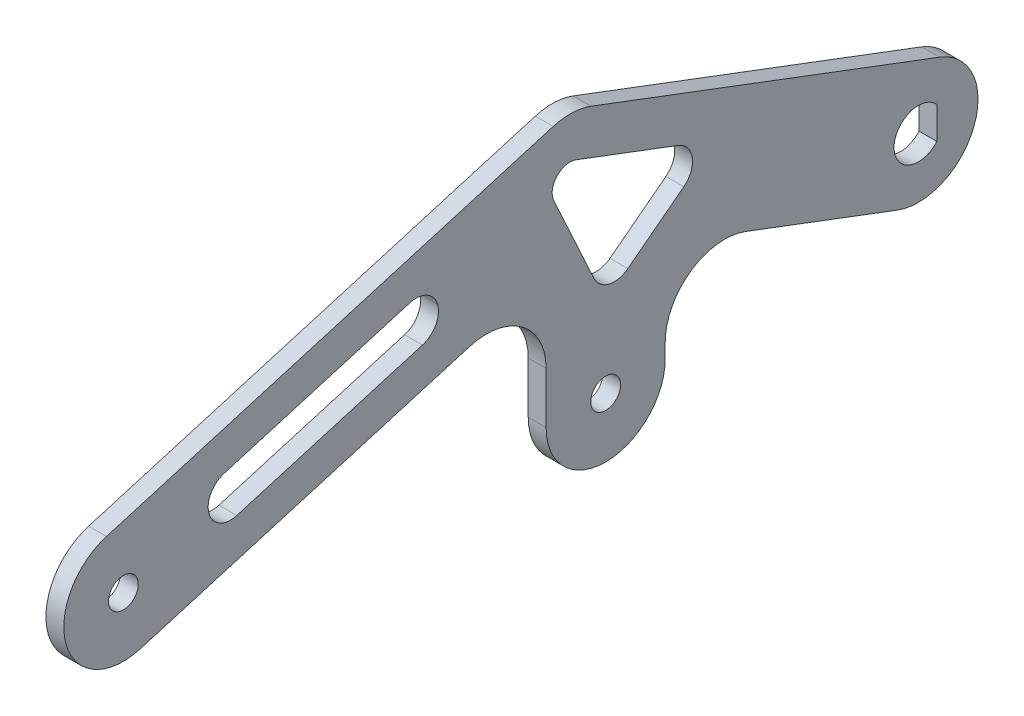
ISO-10303-21;
HEADER;
FILE_DESCRIPTION(('STEP AP214'),'2;1');
FILE_NAME('part.step','',(''),(''),'','','');
FILE_SCHEMA(('AUTOMOTIVE_DESIGN { 1 0 10303 214 1 1 1 1 }'));
ENDSEC;
DATA;
#1=APPLICATION_CONTEXT('core data for automotive mechanical design processes');
#2=APPLICATION_PROTOCOL_DEFINITION('international standard','automotive_design',2000,#1);
#3=PRODUCT_CONTEXT('',#1,'mechanical');
#4=PRODUCT('Part','Part','',(#3));
#5=PRODUCT_RELATED_PRODUCT_CATEGORY('part','',(#4));
#6=PRODUCT_DEFINITION_FORMATION('','',#4);
#7=PRODUCT_DEFINITION_CONTEXT('part definition',#1,'design');
#8=PRODUCT_DEFINITION('design','',#6,#7);
#9=PRODUCT_DEFINITION_SHAPE('','',#8);
#10=(LENGTH_UNIT() NAMED_UNIT(*) SI_UNIT(.MILLI.,.METRE.));
#11=(NAMED_UNIT(*) PLANE_ANGLE_UNIT() SI_UNIT($,.RADIAN.));
#12=(NAMED_UNIT(*) SI_UNIT($,.STERADIAN.) SOLID_ANGLE_UNIT());
#13=UNCERTAINTY_MEASURE_WITH_UNIT(LENGTH_MEASURE(1.E-05),#10,'distance_accuracy_value','');
#14=(GEOMETRIC_REPRESENTATION_CONTEXT(3) GLOBAL_UNCERTAINTY_ASSIGNED_CONTEXT((#13)) GLOBAL_UNIT_ASSIGNED_CONTEXT((#10,
#11,#12)) REPRESENTATION_CONTEXT('',''));
#15=CARTESIAN_POINT('',(0.,0.,0.));
#16=DIRECTION('',(0.,0.,1.));
#17=DIRECTION('',(1.,0.,0.));
#18=AXIS2_PLACEMENT_3D('',#15,#16,#17);
#19=CARTESIAN_POINT('',(3.,-1.49353266513425,-90.9802292545983));
#20=DIRECTION('',(1.,0.,0.));
#21=DIRECTION('',(0.,0.,-1.));
#22=AXIS2_PLACEMENT_3D('',#19,#20,#21);
#23=PLANE('',#22);
#24=DIRECTION('',(0.,1.,0.));
#25=VECTOR('',#24,1.);
#26=CARTESIAN_POINT('',(3.,12.6832815729998,-146.6));
#27=LINE('',#26,#25);
#28=CARTESIAN_POINT('',(3.,7.31671842700024,-146.6));
#29=VERTEX_POINT('',#28);
#30=CARTESIAN_POINT('',(3.,12.6832815729998,-146.6));
#31=VERTEX_POINT('',#30);
#32=EDGE_CURVE('E295',#29,#31,#27,.T.);
#33=ORIENTED_EDGE('',*,*,#32,.F.);
#34=CARTESIAN_POINT('',(3.,10.,-143.5));
#35=DIRECTION('',(1.,0.,0.));
#36=DIRECTION('',(0.,0.,-1.));
#37=AXIS2_PLACEMENT_3D('',#34,#35,#36);
#38=CIRCLE('',#37,4.1);
#39=EDGE_CURVE('E291',#31,#29,#38,.T.);
#40=ORIENTED_EDGE('',*,*,#39,.F.);
#41=EDGE_LOOP('',(#33,#40));
#42=FACE_BOUND('',#41,.T.);
#43=DIRECTION('',(0.,0.282841783069722,-0.959166578728607));
#44=VECTOR('',#43,1.);
#45=CARTESIAN_POINT('',(3.,0.408334212721614,-12.8284178306949));
#46=LINE('',#45,#44);
#47=CARTESIAN_POINT('',(3.,0.408334212721614,-12.8284178306949));
#48=VERTEX_POINT('',#47);
#49=CARTESIAN_POINT('',(3.,16.7222546895087,-68.1518114239011));
#50=VERTEX_POINT('',#49);
#51=EDGE_CURVE('E343',#48,#50,#46,.T.);
#52=ORIENTED_EDGE('',*,*,#51,.T.);
#53=CARTESIAN_POINT('',(3.,7.13058890222264,-70.9802292545983));
#54=DIRECTION('',(1.,0.,0.));
#55=DIRECTION('',(0.,0.,-1.));
#56=AXIS2_PLACEMENT_3D('',#53,#54,#55);
#57=CIRCLE('',#56,10.);
#58=CARTESIAN_POINT('',(3.,7.13058890222264,-80.9802292545983));
#59=VERTEX_POINT('',#58);
#60=EDGE_CURVE('E263',#50,#59,#57,.F.);
#61=ORIENTED_EDGE('',*,*,#60,.T.);
#62=DIRECTION('',(0.,-1.,0.));
#63=VECTOR('',#62,1.);
#64=CARTESIAN_POINT('',(3.,20.5051352169009,-80.9802292545983));
#65=LINE('',#64,#63);
#66=CARTESIAN_POINT('',(3.,-1.49353266513425,-80.9802292545983));
#67=VERTEX_POINT('',#66);
#68=EDGE_CURVE('E314',#59,#67,#65,.T.);
#69=ORIENTED_EDGE('',*,*,#68,.T.);
#70=CARTESIAN_POINT('',(3.,-1.49353266513425,-90.9802292545983));
#71=DIRECTION('',(1.,0.,0.));
#72=DIRECTION('',(0.,0.,-1.));
#73=AXIS2_PLACEMENT_3D('',#70,#71,#72);
#74=CIRCLE('',#73,9.99999999999999);
#75=CARTESIAN_POINT('',(3.,-1.49353266513425,-100.980229254598));
#76=VERTEX_POINT('',#75);
#77=EDGE_CURVE('E317',#67,#76,#74,.T.);
#78=ORIENTED_EDGE('',*,*,#77,.T.);
#79=DIRECTION('',(0.,1.,0.));
#80=VECTOR('',#79,1.);
#81=CARTESIAN_POINT('',(3.,15.3840401127578,-100.980229254598));
#82=LINE('',#81,#80);
#83=CARTESIAN_POINT('',(3.,0.912721051605862,-100.980229254598));
#84=VERTEX_POINT('',#83);
#85=EDGE_CURVE('E321',#76,#84,#82,.T.);
#86=ORIENTED_EDGE('',*,*,#85,.T.);
#87=CARTESIAN_POINT('',(3.,0.912721051605853,-110.980229254598));
#88=DIRECTION('',(1.,0.,0.));
#89=DIRECTION('',(0.,0.,-1.));
#90=AXIS2_PLACEMENT_3D('',#87,#88,#89);
#91=CIRCLE('',#90,10.);
#92=CARTESIAN_POINT('',(3.,10.2665846063096,-114.516503650058));
#93=VERTEX_POINT('',#92);
#94=EDGE_CURVE('E426',#84,#93,#91,.F.);
#95=ORIENTED_EDGE('',*,*,#94,.T.);
#96=DIRECTION('',(0.,-0.353627439545988,-0.935386355470374));
#97=VECTOR('',#96,1.);
#98=CARTESIAN_POINT('',(3.,15.3840401127578,-100.980229254598));
#99=LINE('',#98,#97);
#100=CARTESIAN_POINT('',(3.,0.64613644529626,-139.96372560454));
#101=VERTEX_POINT('',#100);
#102=EDGE_CURVE('E325',#93,#101,#99,.T.);
#103=ORIENTED_EDGE('',*,*,#102,.T.);
#104=CARTESIAN_POINT('',(3.,10.,-143.5));
#105=DIRECTION('',(1.,0.,0.));
#106=DIRECTION('',(0.,0.,-1.));
#107=AXIS2_PLACEMENT_3D('',#104,#105,#106);
#108=CIRCLE('',#107,10.);
#109=CARTESIAN_POINT('',(3.,19.3538635547037,-147.03627439546));
#110=VERTEX_POINT('',#109);
#111=EDGE_CURVE('E328',#101,#110,#108,.T.);
#112=ORIENTED_EDGE('',*,*,#111,.T.);
#113=DIRECTION('',(0.,0.353627439545988,0.935386355470374));
#114=VECTOR('',#113,1.);
#115=CARTESIAN_POINT('',(3.,19.3538635547037,-147.03627439546));
#116=LINE('',#115,#114);
#117=CARTESIAN_POINT('',(3.,41.4700779857315,-88.5362743954599));
#118=VERTEX_POINT('',#117);
#119=EDGE_CURVE('E331',#110,#118,#116,.T.);
#120=ORIENTED_EDGE('',*,*,#119,.T.);
#121=CARTESIAN_POINT('',(3.,32.1162144310277,-85.));
#122=DIRECTION('',(1.,0.,0.));
#123=DIRECTION('',(0.,0.,-1.));
#124=AXIS2_PLACEMENT_3D('',#121,#122,#123);
#125=CIRCLE('',#124,9.99999999999999);
#126=CARTESIAN_POINT('',(3.,41.7078802183132,-82.1715821693008));
#127=VERTEX_POINT('',#126);
#128=EDGE_CURVE('E334',#118,#127,#125,.T.);
#129=ORIENTED_EDGE('',*,*,#128,.T.);
#130=DIRECTION('',(0.,-0.282841783069918,0.959166578728549));
#131=VECTOR('',#130,1.);
#132=CARTESIAN_POINT('',(3.,19.5916657872778,-7.17158216930308));
#133=LINE('',#132,#131);
#134=CARTESIAN_POINT('',(3.,19.5916657872778,-7.17158216930308));
#135=VERTEX_POINT('',#134);
#136=EDGE_CURVE('E337',#127,#135,#133,.T.);
#137=ORIENTED_EDGE('',*,*,#136,.T.);
#138=CARTESIAN_POINT('',(3.,10.,-10.));
#139=DIRECTION('',(1.,0.,0.));
#140=DIRECTION('',(0.,0.,-1.));
#141=AXIS2_PLACEMENT_3D('',#138,#139,#140);
#142=CIRCLE('',#141,9.99999999999199);
#143=EDGE_CURVE('E340',#135,#48,#142,.T.);
#144=ORIENTED_EDGE('',*,*,#143,.T.);
#145=EDGE_LOOP('',(#52,#61,#69,#78,#86,#95,#103,#112,#120,#129,#137,#144));
#146=FACE_BOUND('',#145,.T.);
#147=CARTESIAN_POINT('',(3.,10.,-10.));
#148=DIRECTION('',(1.,0.,0.));
#149=DIRECTION('',(0.,0.,-1.));
#150=AXIS2_PLACEMENT_3D('',#147,#148,#149);
#151=CIRCLE('',#150,2.5);
#152=CARTESIAN_POINT('',(3.,10.,-12.5));
#153=VERTEX_POINT('',#152);
#154=EDGE_CURVE('E283',#153,#153,#151,.T.);
#155=ORIENTED_EDGE('',*,*,#154,.F.);
#156=EDGE_LOOP('',(#155));
#157=FACE_BOUND('',#156,.T.);
#158=CARTESIAN_POINT('',(3.,-1.49353266513425,-90.9802292545983));
#159=DIRECTION('',(1.,0.,0.));
#160=DIRECTION('',(0.,0.,-1.));
#161=AXIS2_PLACEMENT_3D('',#158,#159,#160);
#162=CIRCLE('',#161,2.49999999999999);
#163=CARTESIAN_POINT('',(3.,-1.49353266513425,-93.4802292545983));
#164=VERTEX_POINT('',#163);
#165=EDGE_CURVE('E270',#164,#164,#162,.T.);
#166=ORIENTED_EDGE('',*,*,#165,.F.);
#167=EDGE_LOOP('',(#166));
#168=FACE_BOUND('',#167,.T.);
#169=DIRECTION('',(0.,-0.353627439545988,-0.935386355470374));
#170=VECTOR('',#169,1.);
#171=CARTESIAN_POINT('',(3.,28.741265144375,-102.410644154323));
#172=LINE('',#171,#170);
#173=CARTESIAN_POINT('',(3.,34.9223734974389,-86.060882318638));
#174=VERTEX_POINT('',#173);
#175=CARTESIAN_POINT('',(3.,28.4635451329216,-103.145246394715));
#176=VERTEX_POINT('',#175);
#177=EDGE_CURVE('E257',#174,#176,#172,.T.);
#178=ORIENTED_EDGE('',*,*,#177,.T.);
#179=CARTESIAN_POINT('',(3.,24.9558462999077,-101.819143496417));
#180=DIRECTION('',(1.,0.,0.));
#181=DIRECTION('',(0.,0.,-1.));
#182=AXIS2_PLACEMENT_3D('',#179,#180,#181);
#183=CIRCLE('',#182,3.75);
#184=CARTESIAN_POINT('',(3.,21.9809519676192,-104.102234320655));
#185=VERTEX_POINT('',#184);
#186=EDGE_CURVE('E472',#176,#185,#183,.F.);
#187=ORIENTED_EDGE('',*,*,#186,.T.);
#188=DIRECTION('',(0.,-0.608824219796667,0.793305155276946));
#189=VECTOR('',#188,1.);
#190=CARTESIAN_POINT('',(3.,6.94202628156058,-84.5063363773015));
#191=LINE('',#190,#189);
#192=CARTESIAN_POINT('',(3.,14.7720847878221,-94.7089951697061));
#193=VERTEX_POINT('',#192);
#194=EDGE_CURVE('E519',#185,#193,#191,.T.);
#195=ORIENTED_EDGE('',*,*,#194,.T.);
#196=CARTESIAN_POINT('',(3.,17.7469791201106,-92.4259043454686));
#197=DIRECTION('',(1.,0.,0.));
#198=DIRECTION('',(0.,0.,-1.));
#199=AXIS2_PLACEMENT_3D('',#196,#197,#198);
#200=CIRCLE('',#199,3.75);
#201=CARTESIAN_POINT('',(3.,16.1816510353007,-89.0182294802702));
#202=VERTEX_POINT('',#201);
#203=EDGE_CURVE('E467',#193,#202,#200,.F.);
#204=ORIENTED_EDGE('',*,*,#203,.T.);
#205=DIRECTION('',(0.,0.908713297386252,0.417420822615985));
#206=VECTOR('',#205,1.);
#207=CARTESIAN_POINT('',(3.,0.84197625683953,-96.064565968472));
#208=LINE('',#207,#206);
#209=CARTESIAN_POINT('',(3.,30.8639519631798,-82.2738601078412));
#210=VERTEX_POINT('',#209);
#211=EDGE_CURVE('E527',#202,#210,#208,.T.);
#212=ORIENTED_EDGE('',*,*,#211,.T.);
#213=CARTESIAN_POINT('',(3.,32.1162144310277,-85.));
#214=DIRECTION('',(1.,0.,0.));
#215=DIRECTION('',(0.,0.,-1.));
#216=AXIS2_PLACEMENT_3D('',#213,#214,#215);
#217=CIRCLE('',#216,3.00000000000001);
#218=EDGE_CURVE('E269',#174,#210,#217,.T.);
#219=ORIENTED_EDGE('',*,*,#218,.F.);
#220=EDGE_LOOP('',(#178,#187,#195,#204,#212,#219));
#221=FACE_BOUND('',#220,.T.);
#222=CARTESIAN_POINT('',(3.,24.4956413823256,-59.1572871598404));
#223=DIRECTION('',(1.,0.,0.));
#224=DIRECTION('',(0.,0.,-1.));
#225=AXIS2_PLACEMENT_3D('',#222,#223,#224);
#226=CIRCLE('',#225,3.75);
#227=CARTESIAN_POINT('',(3.,28.0925160525577,-58.0966304733282));
#228=VERTEX_POINT('',#227);
#229=CARTESIAN_POINT('',(3.,25.5562980688378,-62.7541618300724));
#230=VERTEX_POINT('',#229);
#231=EDGE_CURVE('E478',#228,#230,#226,.F.);
#232=ORIENTED_EDGE('',*,*,#231,.T.);
#233=CARTESIAN_POINT('',(3.,24.4956413823256,-59.1572871598404));
#234=DIRECTION('',(1.,0.,0.));
#235=DIRECTION('',(0.,0.,-1.));
#236=AXIS2_PLACEMENT_3D('',#233,#234,#235);
#237=CIRCLE('',#236,3.75);
#238=CARTESIAN_POINT('',(3.,20.8987667120936,-60.2179438463526));
#239=VERTEX_POINT('',#238);
#240=EDGE_CURVE('E484',#230,#239,#237,.F.);
#241=ORIENTED_EDGE('',*,*,#240,.T.);
#242=DIRECTION('',(0.,-0.282841783069918,0.959166578728549));
#243=VECTOR('',#242,1.);
#244=CARTESIAN_POINT('',(3.,27.4529683230725,-82.4444022828199));
#245=LINE('',#244,#243);
#246=CARTESIAN_POINT('',(3.,11.7064087623212,-29.0450300376748));
#247=VERTEX_POINT('',#246);
#248=EDGE_CURVE('E518',#239,#247,#245,.T.);
#249=ORIENTED_EDGE('',*,*,#248,.T.);
#250=CARTESIAN_POINT('',(3.,15.3032834325533,-27.9843733511626));
#251=DIRECTION('',(1.,0.,0.));
#252=DIRECTION('',(0.,0.,-1.));
#253=AXIS2_PLACEMENT_3D('',#250,#251,#252);
#254=CIRCLE('',#253,3.75);
#255=CARTESIAN_POINT('',(3.,14.2426267460411,-24.3874986809305));
#256=VERTEX_POINT('',#255);
#257=EDGE_CURVE('E80',#247,#256,#254,.F.);
#258=ORIENTED_EDGE('',*,*,#257,.T.);
#259=CARTESIAN_POINT('',(3.,15.3032834325533,-27.9843733511625));
#260=DIRECTION('',(1.,0.,0.));
#261=DIRECTION('',(0.,0.,-1.));
#262=AXIS2_PLACEMENT_3D('',#259,#260,#261);
#263=CIRCLE('',#262,3.75);
#264=CARTESIAN_POINT('',(3.,18.9001581027853,-26.9237166646504));
#265=VERTEX_POINT('',#264);
#266=EDGE_CURVE('E12',#256,#265,#263,.F.);
#267=ORIENTED_EDGE('',*,*,#266,.T.);
#268=DIRECTION('',(0.,0.282841783069918,-0.959166578728549));
#269=VECTOR('',#268,1.);
#270=CARTESIAN_POINT('',(3.,34.6467176635366,-80.3230889097955));
#271=LINE('',#270,#269);
#272=EDGE_CURVE('E512',#265,#228,#271,.T.);
#273=ORIENTED_EDGE('',*,*,#272,.T.);
#274=EDGE_LOOP('',(#232,#241,#249,#258,#267,#273));
#275=FACE_BOUND('',#274,.T.);
#276=ADVANCED_FACE('F63',(#42,#146,#157,#168,#221,#275),#23,.T.);
#277=CARTESIAN_POINT('',(0.,-1.49353266513425,-90.9802292545983));
#278=DIRECTION('',(1.,0.,0.));
#279=DIRECTION('',(0.,0.,-1.));
#280=AXIS2_PLACEMENT_3D('',#277,#278,#279);
#281=PLANE('',#280);
#282=DIRECTION('',(0.,-0.908713297386252,-0.417420822615985));
#283=VECTOR('',#282,1.);
#284=CARTESIAN_POINT('',(0.,11.9104331472534,-90.9802292545983));
#285=LINE('',#284,#283);
#286=CARTESIAN_POINT('',(0.,30.8639519631798,-82.2738601078412));
#287=VERTEX_POINT('',#286);
#288=CARTESIAN_POINT('',(0.,16.1816510353007,-89.0182294802702));
#289=VERTEX_POINT('',#288);
#290=EDGE_CURVE('E896',#287,#289,#285,.T.);
#291=ORIENTED_EDGE('',*,*,#290,.T.);
#292=CARTESIAN_POINT('',(0.,17.7469791201106,-92.4259043454686));
#293=DIRECTION('',(1.,0.,0.));
#294=DIRECTION('',(0.,0.,-1.));
#295=AXIS2_PLACEMENT_3D('',#292,#293,#294);
#296=CIRCLE('',#295,3.75);
#297=CARTESIAN_POINT('',(0.,14.7720847878221,-94.7089951697061));
#298=VERTEX_POINT('',#297);
#299=EDGE_CURVE('E464',#289,#298,#296,.T.);
#300=ORIENTED_EDGE('',*,*,#299,.T.);
#301=DIRECTION('',(0.,0.608824219796667,-0.793305155276946));
#302=VECTOR('',#301,1.);
#303=CARTESIAN_POINT('',(0.,26.0816875087892,-109.445541205397));
#304=LINE('',#303,#302);
#305=CARTESIAN_POINT('',(0.,21.9809519676192,-104.102234320655));
#306=VERTEX_POINT('',#305);
#307=EDGE_CURVE('E250',#298,#306,#304,.T.);
#308=ORIENTED_EDGE('',*,*,#307,.T.);
#309=CARTESIAN_POINT('',(0.,24.9558462999077,-101.819143496417));
#310=DIRECTION('',(1.,0.,0.));
#311=DIRECTION('',(0.,0.,-1.));
#312=AXIS2_PLACEMENT_3D('',#309,#310,#311);
#313=CIRCLE('',#312,3.75);
#314=CARTESIAN_POINT('',(0.,28.4635451329216,-103.145246394715));
#315=VERTEX_POINT('',#314);
#316=EDGE_CURVE('E246',#306,#315,#313,.T.);
#317=ORIENTED_EDGE('',*,*,#316,.T.);
#318=DIRECTION('',(0.,0.353627439545988,0.935386355470374));
#319=VECTOR('',#318,1.);
#320=CARTESIAN_POINT('',(0.,34.9223734974389,-86.060882318638));
#321=LINE('',#320,#319);
#322=CARTESIAN_POINT('',(0.,34.9223734974389,-86.060882318638));
#323=VERTEX_POINT('',#322);
#324=EDGE_CURVE('E238',#315,#323,#321,.T.);
#325=ORIENTED_EDGE('',*,*,#324,.T.);
#326=CARTESIAN_POINT('',(0.,32.1162144310277,-85.));
#327=DIRECTION('',(1.,0.,0.));
#328=DIRECTION('',(0.,0.,-1.));
#329=AXIS2_PLACEMENT_3D('',#326,#327,#328);
#330=CIRCLE('',#329,3.00000000000001);
#331=EDGE_CURVE('E244',#323,#287,#330,.T.);
#332=ORIENTED_EDGE('',*,*,#331,.T.);
#333=EDGE_LOOP('',(#291,#300,#308,#317,#325,#332));
#334=FACE_BOUND('',#333,.T.);
#335=DIRECTION('',(0.,-1.,0.));
#336=VECTOR('',#335,1.);
#337=CARTESIAN_POINT('',(0.,20.5051352169009,-80.9802292545983));
#338=LINE('',#337,#336);
#339=CARTESIAN_POINT('',(0.,7.13058890222264,-80.9802292545983));
#340=VERTEX_POINT('',#339);
#341=CARTESIAN_POINT('',(0.,-1.49353266513425,-80.9802292545983));
#342=VERTEX_POINT('',#341);
#343=EDGE_CURVE('E313',#340,#342,#338,.T.);
#344=ORIENTED_EDGE('',*,*,#343,.F.);
#345=CARTESIAN_POINT('',(0.,7.13058890222264,-70.9802292545983));
#346=DIRECTION('',(1.,0.,0.));
#347=DIRECTION('',(0.,0.,-1.));
#348=AXIS2_PLACEMENT_3D('',#345,#346,#347);
#349=CIRCLE('',#348,10.);
#350=CARTESIAN_POINT('',(0.,16.7222546895087,-68.1518114239011));
#351=VERTEX_POINT('',#350);
#352=EDGE_CURVE('E429',#340,#351,#349,.T.);
#353=ORIENTED_EDGE('',*,*,#352,.T.);
#354=DIRECTION('',(0.,0.282841783069722,-0.959166578728607));
#355=VECTOR('',#354,1.);
#356=CARTESIAN_POINT('',(0.,0.408334212721614,-12.8284178306949));
#357=LINE('',#356,#355);
#358=CARTESIAN_POINT('',(0.,0.408334212721614,-12.8284178306949));
#359=VERTEX_POINT('',#358);
#360=EDGE_CURVE('E318',#359,#351,#357,.T.);
#361=ORIENTED_EDGE('',*,*,#360,.F.);
#362=CARTESIAN_POINT('',(0.,10.,-10.));
#363=DIRECTION('',(1.,0.,0.));
#364=DIRECTION('',(0.,0.,-1.));
#365=AXIS2_PLACEMENT_3D('',#362,#363,#364);
#366=CIRCLE('',#365,9.99999999999199);
#367=CARTESIAN_POINT('',(0.,19.5916657872778,-7.17158216930308));
#368=VERTEX_POINT('',#367);
#369=EDGE_CURVE('E372',#368,#359,#366,.T.);
#370=ORIENTED_EDGE('',*,*,#369,.F.);
#371=DIRECTION('',(0.,-0.282841783069918,0.959166578728549));
#372=VECTOR('',#371,1.);
#373=CARTESIAN_POINT('',(0.,19.5916657872778,-7.17158216930308));
#374=LINE('',#373,#372);
#375=CARTESIAN_POINT('',(0.,41.7078802183132,-82.1715821693008));
#376=VERTEX_POINT('',#375);
#377=EDGE_CURVE('E369',#376,#368,#374,.T.);
#378=ORIENTED_EDGE('',*,*,#377,.F.);
#379=CARTESIAN_POINT('',(0.,32.1162144310277,-85.));
#380=DIRECTION('',(1.,0.,0.));
#381=DIRECTION('',(0.,0.,-1.));
#382=AXIS2_PLACEMENT_3D('',#379,#380,#381);
#383=CIRCLE('',#382,9.99999999999999);
#384=CARTESIAN_POINT('',(0.,41.4700779857315,-88.5362743954599));
#385=VERTEX_POINT('',#384);
#386=EDGE_CURVE('E366',#385,#376,#383,.T.);
#387=ORIENTED_EDGE('',*,*,#386,.F.);
#388=DIRECTION('',(0.,0.353627439545988,0.935386355470374));
#389=VECTOR('',#388,1.);
#390=CARTESIAN_POINT('',(0.,19.3538635547037,-147.03627439546));
#391=LINE('',#390,#389);
#392=CARTESIAN_POINT('',(0.,19.3538635547037,-147.03627439546));
#393=VERTEX_POINT('',#392);
#394=EDGE_CURVE('E363',#393,#385,#391,.T.);
#395=ORIENTED_EDGE('',*,*,#394,.F.);
#396=CARTESIAN_POINT('',(0.,10.,-143.5));
#397=DIRECTION('',(1.,0.,0.));
#398=DIRECTION('',(0.,0.,-1.));
#399=AXIS2_PLACEMENT_3D('',#396,#397,#398);
#400=CIRCLE('',#399,10.);
#401=CARTESIAN_POINT('',(0.,0.64613644529626,-139.96372560454));
#402=VERTEX_POINT('',#401);
#403=EDGE_CURVE('E360',#402,#393,#400,.T.);
#404=ORIENTED_EDGE('',*,*,#403,.F.);
#405=DIRECTION('',(0.,-0.353627439545988,-0.935386355470374));
#406=VECTOR('',#405,1.);
#407=CARTESIAN_POINT('',(0.,15.3840401127578,-100.980229254598));
#408=LINE('',#407,#406);
#409=CARTESIAN_POINT('',(0.,10.2665846063096,-114.516503650058));
#410=VERTEX_POINT('',#409);
#411=EDGE_CURVE('E357',#410,#402,#408,.T.);
#412=ORIENTED_EDGE('',*,*,#411,.F.);
#413=CARTESIAN_POINT('',(0.,0.912721051605853,-110.980229254598));
#414=DIRECTION('',(1.,0.,0.));
#415=DIRECTION('',(0.,0.,-1.));
#416=AXIS2_PLACEMENT_3D('',#413,#414,#415);
#417=CIRCLE('',#416,10.);
#418=CARTESIAN_POINT('',(0.,0.912721051605862,-100.980229254598));
#419=VERTEX_POINT('',#418);
#420=EDGE_CURVE('E423',#410,#419,#417,.T.);
#421=ORIENTED_EDGE('',*,*,#420,.T.);
#422=DIRECTION('',(0.,1.,0.));
#423=VECTOR('',#422,1.);
#424=CARTESIAN_POINT('',(0.,15.3840401127578,-100.980229254598));
#425=LINE('',#424,#423);
#426=CARTESIAN_POINT('',(0.,-1.49353266513425,-100.980229254598));
#427=VERTEX_POINT('',#426);
#428=EDGE_CURVE('E353',#427,#419,#425,.T.);
#429=ORIENTED_EDGE('',*,*,#428,.F.);
#430=CARTESIAN_POINT('',(0.,-1.49353266513425,-90.9802292545983));
#431=DIRECTION('',(1.,0.,0.));
#432=DIRECTION('',(0.,0.,-1.));
#433=AXIS2_PLACEMENT_3D('',#430,#431,#432);
#434=CIRCLE('',#433,9.99999999999999);
#435=EDGE_CURVE('E350',#342,#427,#434,.T.);
#436=ORIENTED_EDGE('',*,*,#435,.F.);
#437=EDGE_LOOP('',(#344,#353,#361,#370,#378,#387,#395,#404,#412,#421,#429,#436));
#438=FACE_BOUND('',#437,.T.);
#439=CARTESIAN_POINT('',(0.,10.,-143.5));
#440=DIRECTION('',(1.,0.,0.));
#441=DIRECTION('',(0.,0.,-1.));
#442=AXIS2_PLACEMENT_3D('',#439,#440,#441);
#443=CIRCLE('',#442,4.1);
#444=CARTESIAN_POINT('',(0.,12.6832815729998,-146.6));
#445=VERTEX_POINT('',#444);
#446=CARTESIAN_POINT('',(0.,7.31671842700024,-146.6));
#447=VERTEX_POINT('',#446);
#448=EDGE_CURVE('E287',#445,#447,#443,.T.);
#449=ORIENTED_EDGE('',*,*,#448,.T.);
#450=DIRECTION('',(0.,1.,0.));
#451=VECTOR('',#450,1.);
#452=CARTESIAN_POINT('',(0.,12.6832815729998,-146.6));
#453=LINE('',#452,#451);
#454=EDGE_CURVE('E296',#447,#445,#453,.T.);
#455=ORIENTED_EDGE('',*,*,#454,.T.);
#456=EDGE_LOOP('',(#449,#455));
#457=FACE_BOUND('',#456,.T.);
#458=CARTESIAN_POINT('',(0.,10.,-10.));
#459=DIRECTION('',(1.,0.,0.));
#460=DIRECTION('',(0.,0.,-1.));
#461=AXIS2_PLACEMENT_3D('',#458,#459,#460);
#462=CIRCLE('',#461,2.5);
#463=CARTESIAN_POINT('',(0.,10.,-12.5));
#464=VERTEX_POINT('',#463);
#465=EDGE_CURVE('E276',#464,#464,#462,.T.);
#466=ORIENTED_EDGE('',*,*,#465,.T.);
#467=EDGE_LOOP('',(#466));
#468=FACE_BOUND('',#467,.T.);
#469=CARTESIAN_POINT('',(0.,-1.49353266513425,-90.9802292545983));
#470=DIRECTION('',(1.,0.,0.));
#471=DIRECTION('',(0.,0.,-1.));
#472=AXIS2_PLACEMENT_3D('',#469,#470,#471);
#473=CIRCLE('',#472,2.49999999999999);
#474=CARTESIAN_POINT('',(0.,-1.49353266513425,-93.4802292545983));
#475=VERTEX_POINT('',#474);
#476=EDGE_CURVE('E279',#475,#475,#473,.T.);
#477=ORIENTED_EDGE('',*,*,#476,.T.);
#478=EDGE_LOOP('',(#477));
#479=FACE_BOUND('',#478,.T.);
#480=DIRECTION('',(0.,-0.282841783069918,0.959166578728549));
#481=VECTOR('',#480,1.);
#482=CARTESIAN_POINT('',(0.,17.8395014162731,-23.3268419944183));
#483=LINE('',#482,#481);
#484=CARTESIAN_POINT('',(0.,28.0925160525577,-58.0966304733282));
#485=VERTEX_POINT('',#484);
#486=CARTESIAN_POINT('',(0.,18.9001581027853,-26.9237166646504));
#487=VERTEX_POINT('',#486);
#488=EDGE_CURVE('E909',#485,#487,#483,.T.);
#489=ORIENTED_EDGE('',*,*,#488,.T.);
#490=CARTESIAN_POINT('',(0.,15.3032834325533,-27.9843733511625));
#491=DIRECTION('',(1.,0.,0.));
#492=DIRECTION('',(0.,0.,-1.));
#493=AXIS2_PLACEMENT_3D('',#490,#491,#492);
#494=CIRCLE('',#493,3.75);
#495=CARTESIAN_POINT('',(0.,14.2426267460411,-24.3874986809305));
#496=VERTEX_POINT('',#495);
#497=EDGE_CURVE('E73',#487,#496,#494,.T.);
#498=ORIENTED_EDGE('',*,*,#497,.T.);
#499=CARTESIAN_POINT('',(0.,15.3032834325533,-27.9843733511626));
#500=DIRECTION('',(1.,0.,0.));
#501=DIRECTION('',(0.,0.,-1.));
#502=AXIS2_PLACEMENT_3D('',#499,#500,#501);
#503=CIRCLE('',#502,3.75);
#504=CARTESIAN_POINT('',(0.,11.7064087623212,-29.0450300376747));
#505=VERTEX_POINT('',#504);
#506=EDGE_CURVE('E487',#496,#505,#503,.T.);
#507=ORIENTED_EDGE('',*,*,#506,.T.);
#508=DIRECTION('',(0.,0.282841783069918,-0.959166578728549));
#509=VECTOR('',#508,1.);
#510=CARTESIAN_POINT('',(0.,21.9594233986058,-63.8148185165846));
#511=LINE('',#510,#509);
#512=CARTESIAN_POINT('',(0.,20.8987667120936,-60.2179438463526));
#513=VERTEX_POINT('',#512);
#514=EDGE_CURVE('E904',#505,#513,#511,.T.);
#515=ORIENTED_EDGE('',*,*,#514,.T.);
#516=CARTESIAN_POINT('',(0.,24.4956413823256,-59.1572871598404));
#517=DIRECTION('',(1.,0.,0.));
#518=DIRECTION('',(0.,0.,-1.));
#519=AXIS2_PLACEMENT_3D('',#516,#517,#518);
#520=CIRCLE('',#519,3.75);
#521=CARTESIAN_POINT('',(0.,25.5562980688378,-62.7541618300724));
#522=VERTEX_POINT('',#521);
#523=EDGE_CURVE('E481',#513,#522,#520,.T.);
#524=ORIENTED_EDGE('',*,*,#523,.T.);
#525=CARTESIAN_POINT('',(0.,24.4956413823256,-59.1572871598404));
#526=DIRECTION('',(1.,0.,0.));
#527=DIRECTION('',(0.,0.,-1.));
#528=AXIS2_PLACEMENT_3D('',#525,#526,#527);
#529=CIRCLE('',#528,3.75);
#530=EDGE_CURVE('E475',#522,#485,#529,.T.);
#531=ORIENTED_EDGE('',*,*,#530,.T.);
#532=EDGE_LOOP('',(#489,#498,#507,#515,#524,#531));
#533=FACE_BOUND('',#532,.T.);
#534=ADVANCED_FACE('F241',(#334,#438,#457,#468,#479,#533),#281,.F.);
#535=CARTESIAN_POINT('',(3.,32.1162144310277,-85.));
#536=DIRECTION('',(-1.,0.,0.));
#537=DIRECTION('',(0.,0.,1.));
#538=AXIS2_PLACEMENT_3D('',#535,#536,#537);
#539=CYLINDRICAL_SURFACE('',#538,3.00000000000001);
#540=ORIENTED_EDGE('',*,*,#218,.T.);
#541=DIRECTION('',(-1.,0.,0.));
#542=VECTOR('',#541,1.);
#543=CARTESIAN_POINT('',(3.,30.8639519631798,-82.2738601078412));
#544=LINE('',#543,#542);
#545=EDGE_CURVE('E262',#210,#287,#544,.T.);
#546=ORIENTED_EDGE('',*,*,#545,.T.);
#547=ORIENTED_EDGE('',*,*,#331,.F.);
#548=DIRECTION('',(-1.,0.,0.));
#549=VECTOR('',#548,1.);
#550=CARTESIAN_POINT('',(3.,34.9223734974389,-86.060882318638));
#551=LINE('',#550,#549);
#552=EDGE_CURVE('E254',#174,#323,#551,.T.);
#553=ORIENTED_EDGE('',*,*,#552,.F.);
#554=EDGE_LOOP('',(#540,#546,#547,#553));
#555=FACE_BOUND('',#554,.T.);
#556=ADVANCED_FACE('F266',(#555),#539,.F.);
#557=CARTESIAN_POINT('',(3.,20.5051352169009,-80.9802292545983));
#558=DIRECTION('',(0.,0.,-1.));
#559=DIRECTION('',(-1.,0.,0.));
#560=AXIS2_PLACEMENT_3D('',#557,#558,#559);
#561=PLANE('',#560);
#562=ORIENTED_EDGE('',*,*,#68,.F.);
#563=DIRECTION('',(-1.,0.,0.));
#564=VECTOR('',#563,1.);
#565=CARTESIAN_POINT('',(0.,7.13058890222264,-80.9802292545983));
#566=LINE('',#565,#564);
#567=EDGE_CURVE('E416',#59,#340,#566,.T.);
#568=ORIENTED_EDGE('',*,*,#567,.T.);
#569=ORIENTED_EDGE('',*,*,#343,.T.);
#570=DIRECTION('',(-1.,0.,0.));
#571=VECTOR('',#570,1.);
#572=CARTESIAN_POINT('',(3.,-1.49353266513425,-80.9802292545983));
#573=LINE('',#572,#571);
#574=EDGE_CURVE('E405',#67,#342,#573,.T.);
#575=ORIENTED_EDGE('',*,*,#574,.F.);
#576=EDGE_LOOP('',(#562,#568,#569,#575));
#577=FACE_BOUND('',#576,.T.);
#578=ADVANCED_FACE('F603',(#577),#561,.F.);
#579=CARTESIAN_POINT('',(3.,-1.49353266513425,-90.9802292545983));
#580=DIRECTION('',(-1.,0.,0.));
#581=DIRECTION('',(0.,0.,1.));
#582=AXIS2_PLACEMENT_3D('',#579,#580,#581);
#583=CYLINDRICAL_SURFACE('',#582,9.99999999999999);
#584=ORIENTED_EDGE('',*,*,#435,.T.);
#585=DIRECTION('',(-1.,0.,0.));
#586=VECTOR('',#585,1.);
#587=CARTESIAN_POINT('',(3.,-1.49353266513425,-100.980229254598));
#588=LINE('',#587,#586);
#589=EDGE_CURVE('E401',#76,#427,#588,.T.);
#590=ORIENTED_EDGE('',*,*,#589,.F.);
#591=ORIENTED_EDGE('',*,*,#77,.F.);
#592=ORIENTED_EDGE('',*,*,#574,.T.);
#593=EDGE_LOOP('',(#584,#590,#591,#592));
#594=FACE_BOUND('',#593,.T.);
#595=ADVANCED_FACE('F599',(#594),#583,.T.);
#596=CARTESIAN_POINT('',(3.,15.3840401127578,-100.980229254598));
#597=DIRECTION('',(0.,0.,1.));
#598=DIRECTION('',(0.,-1.,0.));
#599=AXIS2_PLACEMENT_3D('',#596,#597,#598);
#600=PLANE('',#599);
#601=ORIENTED_EDGE('',*,*,#428,.T.);
#602=DIRECTION('',(-1.,0.,0.));
#603=VECTOR('',#602,1.);
#604=CARTESIAN_POINT('',(3.,0.912721051605861,-100.980229254598));
#605=LINE('',#604,#603);
#606=EDGE_CURVE('E413',#419,#84,#605,.F.);
#607=ORIENTED_EDGE('',*,*,#606,.T.);
#608=ORIENTED_EDGE('',*,*,#85,.F.);
#609=ORIENTED_EDGE('',*,*,#589,.T.);
#610=EDGE_LOOP('',(#601,#607,#608,#609));
#611=FACE_BOUND('',#610,.T.);
#612=ADVANCED_FACE('F595',(#611),#600,.F.);
#613=CARTESIAN_POINT('',(3.,15.3840401127578,-100.980229254598));
#614=DIRECTION('',(0.,0.935386355470374,-0.353627439545988));
#615=DIRECTION('',(0.,0.353627439545988,0.935386355470374));
#616=AXIS2_PLACEMENT_3D('',#613,#614,#615);
#617=PLANE('',#616);
#618=ORIENTED_EDGE('',*,*,#102,.F.);
#619=DIRECTION('',(-1.,0.,0.));
#620=VECTOR('',#619,1.);
#621=CARTESIAN_POINT('',(0.,10.2665846063096,-114.516503650058));
#622=LINE('',#621,#620);
#623=EDGE_CURVE('E409',#93,#410,#622,.T.);
#624=ORIENTED_EDGE('',*,*,#623,.T.);
#625=ORIENTED_EDGE('',*,*,#411,.T.);
#626=DIRECTION('',(-1.,0.,0.));
#627=VECTOR('',#626,1.);
#628=CARTESIAN_POINT('',(3.,0.64613644529626,-139.96372560454));
#629=LINE('',#628,#627);
#630=EDGE_CURVE('E397',#101,#402,#629,.T.);
#631=ORIENTED_EDGE('',*,*,#630,.F.);
#632=EDGE_LOOP('',(#618,#624,#625,#631));
#633=FACE_BOUND('',#632,.T.);
#634=ADVANCED_FACE('F591',(#633),#617,.F.);
#635=CARTESIAN_POINT('',(3.,10.,-143.5));
#636=DIRECTION('',(-1.,0.,0.));
#637=DIRECTION('',(0.,0.,1.));
#638=AXIS2_PLACEMENT_3D('',#635,#636,#637);
#639=CYLINDRICAL_SURFACE('',#638,10.);
#640=ORIENTED_EDGE('',*,*,#403,.T.);
#641=DIRECTION('',(-1.,0.,0.));
#642=VECTOR('',#641,1.);
#643=CARTESIAN_POINT('',(3.,19.3538635547037,-147.03627439546));
#644=LINE('',#643,#642);
#645=EDGE_CURVE('E393',#110,#393,#644,.T.);
#646=ORIENTED_EDGE('',*,*,#645,.F.);
#647=ORIENTED_EDGE('',*,*,#111,.F.);
#648=ORIENTED_EDGE('',*,*,#630,.T.);
#649=EDGE_LOOP('',(#640,#646,#647,#648));
#650=FACE_BOUND('',#649,.T.);
#651=ADVANCED_FACE('F587',(#650),#639,.T.);
#652=CARTESIAN_POINT('',(3.,19.3538635547037,-147.03627439546));
#653=DIRECTION('',(0.,-0.935386355470374,0.353627439545988));
#654=DIRECTION('',(0.,-0.353627439545988,-0.935386355470374));
#655=AXIS2_PLACEMENT_3D('',#652,#653,#654);
#656=PLANE('',#655);
#657=ORIENTED_EDGE('',*,*,#394,.T.);
#658=DIRECTION('',(-1.,0.,0.));
#659=VECTOR('',#658,1.);
#660=CARTESIAN_POINT('',(3.,41.4700779857315,-88.5362743954599));
#661=LINE('',#660,#659);
#662=EDGE_CURVE('E389',#118,#385,#661,.T.);
#663=ORIENTED_EDGE('',*,*,#662,.F.);
#664=ORIENTED_EDGE('',*,*,#119,.F.);
#665=ORIENTED_EDGE('',*,*,#645,.T.);
#666=EDGE_LOOP('',(#657,#663,#664,#665));
#667=FACE_BOUND('',#666,.T.);
#668=ADVANCED_FACE('F583',(#667),#656,.F.);
#669=CARTESIAN_POINT('',(3.,32.1162144310277,-85.));
#670=DIRECTION('',(-1.,0.,0.));
#671=DIRECTION('',(0.,0.,1.));
#672=AXIS2_PLACEMENT_3D('',#669,#670,#671);
#673=CYLINDRICAL_SURFACE('',#672,9.99999999999999);
#674=ORIENTED_EDGE('',*,*,#386,.T.);
#675=DIRECTION('',(-1.,0.,0.));
#676=VECTOR('',#675,1.);
#677=CARTESIAN_POINT('',(3.,41.7078802183132,-82.1715821693008));
#678=LINE('',#677,#676);
#679=EDGE_CURVE('E385',#127,#376,#678,.T.);
#680=ORIENTED_EDGE('',*,*,#679,.F.);
#681=ORIENTED_EDGE('',*,*,#128,.F.);
#682=ORIENTED_EDGE('',*,*,#662,.T.);
#683=EDGE_LOOP('',(#674,#680,#681,#682));
#684=FACE_BOUND('',#683,.T.);
#685=ADVANCED_FACE('F579',(#684),#673,.T.);
#686=CARTESIAN_POINT('',(3.,19.5916657872778,-7.17158216930308));
#687=DIRECTION('',(0.,-0.959166578728549,-0.282841783069918));
#688=DIRECTION('',(0.,0.282841783069918,-0.959166578728549));
#689=AXIS2_PLACEMENT_3D('',#686,#687,#688);
#690=PLANE('',#689);
#691=ORIENTED_EDGE('',*,*,#377,.T.);
#692=DIRECTION('',(-1.,0.,0.));
#693=VECTOR('',#692,1.);
#694=CARTESIAN_POINT('',(3.,19.5916657872778,-7.17158216930308));
#695=LINE('',#694,#693);
#696=EDGE_CURVE('E381',#135,#368,#695,.T.);
#697=ORIENTED_EDGE('',*,*,#696,.F.);
#698=ORIENTED_EDGE('',*,*,#136,.F.);
#699=ORIENTED_EDGE('',*,*,#679,.T.);
#700=EDGE_LOOP('',(#691,#697,#698,#699));
#701=FACE_BOUND('',#700,.T.);
#702=ADVANCED_FACE('F575',(#701),#690,.F.);
#703=CARTESIAN_POINT('',(3.,10.,-10.));
#704=DIRECTION('',(-1.,0.,0.));
#705=DIRECTION('',(0.,0.,1.));
#706=AXIS2_PLACEMENT_3D('',#703,#704,#705);
#707=CYLINDRICAL_SURFACE('',#706,9.99999999999199);
#708=ORIENTED_EDGE('',*,*,#369,.T.);
#709=DIRECTION('',(-1.,0.,0.));
#710=VECTOR('',#709,1.);
#711=CARTESIAN_POINT('',(3.,0.408334212721614,-12.8284178306949));
#712=LINE('',#711,#710);
#713=EDGE_CURVE('E347',#48,#359,#712,.T.);
#714=ORIENTED_EDGE('',*,*,#713,.F.);
#715=ORIENTED_EDGE('',*,*,#143,.F.);
#716=ORIENTED_EDGE('',*,*,#696,.T.);
#717=EDGE_LOOP('',(#708,#714,#715,#716));
#718=FACE_BOUND('',#717,.T.);
#719=ADVANCED_FACE('F571',(#718),#707,.T.);
#720=CARTESIAN_POINT('',(3.,0.408334212721614,-12.8284178306949));
#721=DIRECTION('',(0.,0.959166578728607,0.282841783069722));
#722=DIRECTION('',(0.,-0.282841783069722,0.959166578728607));
#723=AXIS2_PLACEMENT_3D('',#720,#721,#722);
#724=PLANE('',#723);
#725=ORIENTED_EDGE('',*,*,#360,.T.);
#726=DIRECTION('',(-1.,0.,0.));
#727=VECTOR('',#726,1.);
#728=CARTESIAN_POINT('',(3.,16.7222546895087,-68.1518114239011));
#729=LINE('',#728,#727);
#730=EDGE_CURVE('E420',#351,#50,#729,.F.);
#731=ORIENTED_EDGE('',*,*,#730,.T.);
#732=ORIENTED_EDGE('',*,*,#51,.F.);
#733=ORIENTED_EDGE('',*,*,#713,.T.);
#734=EDGE_LOOP('',(#725,#731,#732,#733));
#735=FACE_BOUND('',#734,.T.);
#736=ADVANCED_FACE('F568',(#735),#724,.F.);
#737=CARTESIAN_POINT('',(3.,10.,-143.5));
#738=DIRECTION('',(-1.,0.,0.));
#739=DIRECTION('',(0.,0.,1.));
#740=AXIS2_PLACEMENT_3D('',#737,#738,#739);
#741=CYLINDRICAL_SURFACE('',#740,4.1);
#742=ORIENTED_EDGE('',*,*,#448,.F.);
#743=DIRECTION('',(-1.,0.,0.));
#744=VECTOR('',#743,1.);
#745=CARTESIAN_POINT('',(3.,12.6832815729998,-146.6));
#746=LINE('',#745,#744);
#747=EDGE_CURVE('E299',#31,#445,#746,.T.);
#748=ORIENTED_EDGE('',*,*,#747,.F.);
#749=ORIENTED_EDGE('',*,*,#39,.T.);
#750=DIRECTION('',(-1.,0.,0.));
#751=VECTOR('',#750,1.);
#752=CARTESIAN_POINT('',(3.,7.31671842700024,-146.6));
#753=LINE('',#752,#751);
#754=EDGE_CURVE('E309',#29,#447,#753,.T.);
#755=ORIENTED_EDGE('',*,*,#754,.T.);
#756=EDGE_LOOP('',(#742,#748,#749,#755));
#757=FACE_BOUND('',#756,.T.);
#758=ADVANCED_FACE('F565',(#757),#741,.F.);
#759=CARTESIAN_POINT('',(3.,12.6832815729998,-146.6));
#760=DIRECTION('',(0.,0.,1.));
#761=DIRECTION('',(1.,0.,0.));
#762=AXIS2_PLACEMENT_3D('',#759,#760,#761);
#763=PLANE('',#762);
#764=ORIENTED_EDGE('',*,*,#454,.F.);
#765=ORIENTED_EDGE('',*,*,#754,.F.);
#766=ORIENTED_EDGE('',*,*,#32,.T.);
#767=ORIENTED_EDGE('',*,*,#747,.T.);
#768=EDGE_LOOP('',(#764,#765,#766,#767));
#769=FACE_BOUND('',#768,.T.);
#770=ADVANCED_FACE('F550',(#769),#763,.T.);
#771=CARTESIAN_POINT('',(3.,10.,-10.));
#772=DIRECTION('',(-1.,0.,0.));
#773=DIRECTION('',(0.,0.,1.));
#774=AXIS2_PLACEMENT_3D('',#771,#772,#773);
#775=CYLINDRICAL_SURFACE('',#774,2.5);
#776=ORIENTED_EDGE('',*,*,#154,.T.);
#777=EDGE_LOOP('',(#776));
#778=FACE_BOUND('',#777,.T.);
#779=ORIENTED_EDGE('',*,*,#465,.F.);
#780=EDGE_LOOP('',(#779));
#781=FACE_BOUND('',#780,.T.);
#782=ADVANCED_FACE('F540',(#778,#781),#775,.F.);
#783=CARTESIAN_POINT('',(3.,-1.49353266513425,-90.9802292545983));
#784=DIRECTION('',(-1.,0.,0.));
#785=DIRECTION('',(0.,0.,1.));
#786=AXIS2_PLACEMENT_3D('',#783,#784,#785);
#787=CYLINDRICAL_SURFACE('',#786,2.49999999999999);
#788=ORIENTED_EDGE('',*,*,#165,.T.);
#789=EDGE_LOOP('',(#788));
#790=FACE_BOUND('',#789,.T.);
#791=ORIENTED_EDGE('',*,*,#476,.F.);
#792=EDGE_LOOP('',(#791));
#793=FACE_BOUND('',#792,.T.);
#794=ADVANCED_FACE('F537',(#790,#793),#787,.F.);
#795=CARTESIAN_POINT('',(3.,0.912721051605853,-110.980229254598));
#796=DIRECTION('',(1.,0.,0.));
#797=DIRECTION('',(0.,0.,-1.));
#798=AXIS2_PLACEMENT_3D('',#795,#796,#797);
#799=CYLINDRICAL_SURFACE('',#798,10.);
#800=ORIENTED_EDGE('',*,*,#94,.F.);
#801=ORIENTED_EDGE('',*,*,#606,.F.);
#802=ORIENTED_EDGE('',*,*,#420,.F.);
#803=ORIENTED_EDGE('',*,*,#623,.F.);
#804=EDGE_LOOP('',(#800,#801,#802,#803));
#805=FACE_BOUND('',#804,.T.);
#806=ADVANCED_FACE('F539',(#805),#799,.F.);
#807=CARTESIAN_POINT('',(3.,7.13058890222264,-70.9802292545983));
#808=DIRECTION('',(1.,0.,0.));
#809=DIRECTION('',(0.,0.,-1.));
#810=AXIS2_PLACEMENT_3D('',#807,#808,#809);
#811=CYLINDRICAL_SURFACE('',#810,10.);
#812=ORIENTED_EDGE('',*,*,#60,.F.);
#813=ORIENTED_EDGE('',*,*,#730,.F.);
#814=ORIENTED_EDGE('',*,*,#352,.F.);
#815=ORIENTED_EDGE('',*,*,#567,.F.);
#816=EDGE_LOOP('',(#812,#813,#814,#815));
#817=FACE_BOUND('',#816,.T.);
#818=ADVANCED_FACE('F547',(#817),#811,.F.);
#819=CARTESIAN_POINT('',(10.,11.9104331472534,-90.9802292545983));
#820=DIRECTION('',(0.,0.417420822615985,-0.908713297386252));
#821=DIRECTION('',(0.,0.908713297386252,0.417420822615985));
#822=AXIS2_PLACEMENT_3D('',#819,#820,#821);
#823=PLANE('',#822);
#824=ORIENTED_EDGE('',*,*,#211,.F.);
#825=DIRECTION('',(-1.,0.,0.));
#826=VECTOR('',#825,1.);
#827=CARTESIAN_POINT('',(0.,16.1816510353007,-89.0182294802702));
#828=LINE('',#827,#826);
#829=EDGE_CURVE('E436',#202,#289,#828,.T.);
#830=ORIENTED_EDGE('',*,*,#829,.T.);
#831=ORIENTED_EDGE('',*,*,#290,.F.);
#832=ORIENTED_EDGE('',*,*,#545,.F.);
#833=EDGE_LOOP('',(#824,#830,#831,#832));
#834=FACE_BOUND('',#833,.T.);
#835=ADVANCED_FACE('F610',(#834),#823,.T.);
#836=CARTESIAN_POINT('',(10.,26.0816875087892,-109.445541205397));
#837=DIRECTION('',(0.,0.793305155276946,0.608824219796667));
#838=DIRECTION('',(0.,-0.608824219796667,0.793305155276946));
#839=AXIS2_PLACEMENT_3D('',#836,#837,#838);
#840=PLANE('',#839);
#841=ORIENTED_EDGE('',*,*,#307,.F.);
#842=DIRECTION('',(-1.,0.,0.));
#843=VECTOR('',#842,1.);
#844=CARTESIAN_POINT('',(3.,14.7720847878221,-94.7089951697061));
#845=LINE('',#844,#843);
#846=EDGE_CURVE('E444',#298,#193,#845,.F.);
#847=ORIENTED_EDGE('',*,*,#846,.T.);
#848=ORIENTED_EDGE('',*,*,#194,.F.);
#849=DIRECTION('',(-1.,0.,0.));
#850=VECTOR('',#849,1.);
#851=CARTESIAN_POINT('',(0.,21.9809519676192,-104.102234320655));
#852=LINE('',#851,#850);
#853=EDGE_CURVE('E440',#185,#306,#852,.T.);
#854=ORIENTED_EDGE('',*,*,#853,.T.);
#855=EDGE_LOOP('',(#841,#847,#848,#854));
#856=FACE_BOUND('',#855,.T.);
#857=ADVANCED_FACE('F668',(#856),#840,.T.);
#858=CARTESIAN_POINT('',(10.,34.9223734974389,-86.060882318638));
#859=DIRECTION('',(0.,-0.935386355470374,0.353627439545988));
#860=DIRECTION('',(0.,-0.353627439545988,-0.935386355470374));
#861=AXIS2_PLACEMENT_3D('',#858,#859,#860);
#862=PLANE('',#861);
#863=ORIENTED_EDGE('',*,*,#324,.F.);
#864=DIRECTION('',(-1.,0.,0.));
#865=VECTOR('',#864,1.);
#866=CARTESIAN_POINT('',(3.,28.4635451329216,-103.145246394715));
#867=LINE('',#866,#865);
#868=EDGE_CURVE('E447',#315,#176,#867,.F.);
#869=ORIENTED_EDGE('',*,*,#868,.T.);
#870=ORIENTED_EDGE('',*,*,#177,.F.);
#871=ORIENTED_EDGE('',*,*,#552,.T.);
#872=EDGE_LOOP('',(#863,#869,#870,#871));
#873=FACE_BOUND('',#872,.T.);
#874=ADVANCED_FACE('F255',(#873),#862,.T.);
#875=CARTESIAN_POINT('',(10.,21.9594233986058,-63.8148185165846));
#876=DIRECTION('',(0.,0.959166578728549,0.282841783069918));
#877=DIRECTION('',(0.,-0.282841783069918,0.959166578728549));
#878=AXIS2_PLACEMENT_3D('',#875,#876,#877);
#879=PLANE('',#878);
#880=ORIENTED_EDGE('',*,*,#248,.F.);
#881=DIRECTION('',(-1.,0.,0.));
#882=VECTOR('',#881,1.);
#883=CARTESIAN_POINT('',(0.,20.8987667120936,-60.2179438463526));
#884=LINE('',#883,#882);
#885=EDGE_CURVE('E461',#239,#513,#884,.T.);
#886=ORIENTED_EDGE('',*,*,#885,.T.);
#887=ORIENTED_EDGE('',*,*,#514,.F.);
#888=DIRECTION('',(-1.,0.,0.));
#889=VECTOR('',#888,1.);
#890=CARTESIAN_POINT('',(3.,11.7064087623212,-29.0450300376747));
#891=LINE('',#890,#889);
#892=EDGE_CURVE('E457',#505,#247,#891,.F.);
#893=ORIENTED_EDGE('',*,*,#892,.T.);
#894=EDGE_LOOP('',(#880,#886,#887,#893));
#895=FACE_BOUND('',#894,.T.);
#896=ADVANCED_FACE('F654',(#895),#879,.T.);
#897=CARTESIAN_POINT('',(10.,17.8395014162731,-23.3268419944183));
#898=DIRECTION('',(0.,-0.959166578728549,-0.282841783069918));
#899=DIRECTION('',(0.,0.282841783069918,-0.959166578728549));
#900=AXIS2_PLACEMENT_3D('',#897,#898,#899);
#901=PLANE('',#900);
#902=ORIENTED_EDGE('',*,*,#488,.F.);
#903=DIRECTION('',(-1.,0.,0.));
#904=VECTOR('',#903,1.);
#905=CARTESIAN_POINT('',(3.,28.0925160525577,-58.0966304733282));
#906=LINE('',#905,#904);
#907=EDGE_CURVE('E453',#485,#228,#906,.F.);
#908=ORIENTED_EDGE('',*,*,#907,.T.);
#909=ORIENTED_EDGE('',*,*,#272,.F.);
#910=DIRECTION('',(-1.,0.,0.));
#911=VECTOR('',#910,1.);
#912=CARTESIAN_POINT('',(0.,18.9001581027853,-26.9237166646504));
#913=LINE('',#912,#911);
#914=EDGE_CURVE('E450',#265,#487,#913,.T.);
#915=ORIENTED_EDGE('',*,*,#914,.T.);
#916=EDGE_LOOP('',(#902,#908,#909,#915));
#917=FACE_BOUND('',#916,.T.);
#918=ADVANCED_FACE('F515',(#917),#901,.T.);
#919=CARTESIAN_POINT('',(10.,17.7469791201106,-92.4259043454686));
#920=DIRECTION('',(1.,0.,0.));
#921=DIRECTION('',(0.,0.,-1.));
#922=AXIS2_PLACEMENT_3D('',#919,#920,#921);
#923=CYLINDRICAL_SURFACE('',#922,3.75);
#924=ORIENTED_EDGE('',*,*,#203,.F.);
#925=ORIENTED_EDGE('',*,*,#846,.F.);
#926=ORIENTED_EDGE('',*,*,#299,.F.);
#927=ORIENTED_EDGE('',*,*,#829,.F.);
#928=EDGE_LOOP('',(#924,#925,#926,#927));
#929=FACE_BOUND('',#928,.T.);
#930=ADVANCED_FACE('F612',(#929),#923,.F.);
#931=CARTESIAN_POINT('',(10.,24.9558462999077,-101.819143496417));
#932=DIRECTION('',(1.,0.,0.));
#933=DIRECTION('',(0.,0.,-1.));
#934=AXIS2_PLACEMENT_3D('',#931,#932,#933);
#935=CYLINDRICAL_SURFACE('',#934,3.75);
#936=ORIENTED_EDGE('',*,*,#186,.F.);
#937=ORIENTED_EDGE('',*,*,#868,.F.);
#938=ORIENTED_EDGE('',*,*,#316,.F.);
#939=ORIENTED_EDGE('',*,*,#853,.F.);
#940=EDGE_LOOP('',(#936,#937,#938,#939));
#941=FACE_BOUND('',#940,.T.);
#942=ADVANCED_FACE('F615',(#941),#935,.F.);
#943=CARTESIAN_POINT('',(10.,24.4956413823256,-59.1572871598404));
#944=DIRECTION('',(1.,0.,0.));
#945=DIRECTION('',(0.,0.,-1.));
#946=AXIS2_PLACEMENT_3D('',#943,#944,#945);
#947=CYLINDRICAL_SURFACE('',#946,3.75);
#948=ORIENTED_EDGE('',*,*,#885,.F.);
#949=ORIENTED_EDGE('',*,*,#240,.F.);
#950=DIRECTION('',(-1.,0.,0.));
#951=VECTOR('',#950,1.);
#952=CARTESIAN_POINT('',(3.,25.5562980688378,-62.7541618300724));
#953=LINE('',#952,#951);
#954=EDGE_CURVE('E251',#522,#230,#953,.F.);
#955=ORIENTED_EDGE('',*,*,#954,.F.);
#956=ORIENTED_EDGE('',*,*,#523,.F.);
#957=EDGE_LOOP('',(#948,#949,#955,#956));
#958=FACE_BOUND('',#957,.T.);
#959=ADVANCED_FACE('F619',(#958),#947,.F.);
#960=CARTESIAN_POINT('',(10.,24.4956413823256,-59.1572871598404));
#961=DIRECTION('',(1.,0.,0.));
#962=DIRECTION('',(0.,0.,-1.));
#963=AXIS2_PLACEMENT_3D('',#960,#961,#962);
#964=CYLINDRICAL_SURFACE('',#963,3.75);
#965=ORIENTED_EDGE('',*,*,#231,.F.);
#966=ORIENTED_EDGE('',*,*,#907,.F.);
#967=ORIENTED_EDGE('',*,*,#530,.F.);
#968=ORIENTED_EDGE('',*,*,#954,.T.);
#969=EDGE_LOOP('',(#965,#966,#967,#968));
#970=FACE_BOUND('',#969,.T.);
#971=ADVANCED_FACE('F621',(#970),#964,.F.);
#972=CARTESIAN_POINT('',(10.,15.3032834325533,-27.9843733511625));
#973=DIRECTION('',(1.,0.,0.));
#974=DIRECTION('',(0.,0.,-1.));
#975=AXIS2_PLACEMENT_3D('',#972,#973,#974);
#976=CYLINDRICAL_SURFACE('',#975,3.75);
#977=ORIENTED_EDGE('',*,*,#914,.F.);
#978=ORIENTED_EDGE('',*,*,#266,.F.);
#979=DIRECTION('',(-1.,0.,0.));
#980=VECTOR('',#979,1.);
#981=CARTESIAN_POINT('',(3.,14.2426267460411,-24.3874986809305));
#982=LINE('',#981,#980);
#983=EDGE_CURVE('E67',#496,#256,#982,.F.);
#984=ORIENTED_EDGE('',*,*,#983,.F.);
#985=ORIENTED_EDGE('',*,*,#497,.F.);
#986=EDGE_LOOP('',(#977,#978,#984,#985));
#987=FACE_BOUND('',#986,.T.);
#988=ADVANCED_FACE('F65',(#987),#976,.F.);
#989=CARTESIAN_POINT('',(10.,15.3032834325533,-27.9843733511626));
#990=DIRECTION('',(1.,0.,0.));
#991=DIRECTION('',(0.,0.,-1.));
#992=AXIS2_PLACEMENT_3D('',#989,#990,#991);
#993=CYLINDRICAL_SURFACE('',#992,3.75);
#994=ORIENTED_EDGE('',*,*,#257,.F.);
#995=ORIENTED_EDGE('',*,*,#892,.F.);
#996=ORIENTED_EDGE('',*,*,#506,.F.);
#997=ORIENTED_EDGE('',*,*,#983,.T.);
#998=EDGE_LOOP('',(#994,#995,#996,#997));
#999=FACE_BOUND('',#998,.T.);
#1000=ADVANCED_FACE('F506',(#999),#993,.F.);
#1001=CLOSED_SHELL('',(#276,#534,#556,#578,#595,#612,#634,#651,#668,#685,#702,#719,#736,#758,
#770,#782,#794,#806,#818,#835,#857,#874,#896,#918,#930,#942,#959,#971,#988,#1000));
#1002=MANIFOLD_SOLID_BREP('B2',#1001);
#1003=ADVANCED_BREP_SHAPE_REPRESENTATION('',(#18,#1002),#14);
#1004=SHAPE_DEFINITION_REPRESENTATION(#9,#1003);
ENDSEC;
END-ISO-10303-21;
